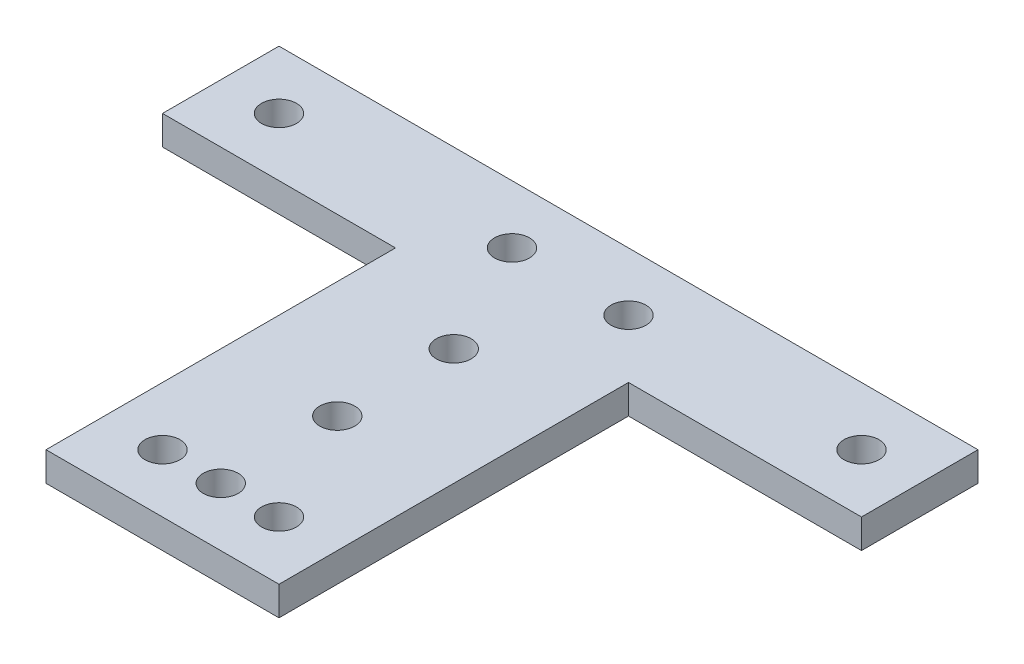
ISO-10303-21;
HEADER;
FILE_DESCRIPTION(('STEP AP214'),'2;1');
FILE_NAME('part.step','',(''),(''),'','','');
FILE_SCHEMA(('AUTOMOTIVE_DESIGN { 1 0 10303 214 1 1 1 1 }'));
ENDSEC;
DATA;
#1=APPLICATION_CONTEXT('core data for automotive mechanical design processes');
#2=APPLICATION_PROTOCOL_DEFINITION('international standard','automotive_design',2000,#1);
#3=PRODUCT_CONTEXT('',#1,'mechanical');
#4=PRODUCT('Part','Part','',(#3));
#5=PRODUCT_RELATED_PRODUCT_CATEGORY('part','',(#4));
#6=PRODUCT_DEFINITION_FORMATION('','',#4);
#7=PRODUCT_DEFINITION_CONTEXT('part definition',#1,'design');
#8=PRODUCT_DEFINITION('design','',#6,#7);
#9=PRODUCT_DEFINITION_SHAPE('','',#8);
#10=(LENGTH_UNIT() NAMED_UNIT(*) SI_UNIT(.MILLI.,.METRE.));
#11=(NAMED_UNIT(*) PLANE_ANGLE_UNIT() SI_UNIT($,.RADIAN.));
#12=(NAMED_UNIT(*) SI_UNIT($,.STERADIAN.) SOLID_ANGLE_UNIT());
#13=UNCERTAINTY_MEASURE_WITH_UNIT(LENGTH_MEASURE(1.E-05),#10,'distance_accuracy_value','');
#14=(GEOMETRIC_REPRESENTATION_CONTEXT(3) GLOBAL_UNCERTAINTY_ASSIGNED_CONTEXT((#13)) GLOBAL_UNIT_ASSIGNED_CONTEXT((#10,
#11,#12)) REPRESENTATION_CONTEXT('',''));
#15=CARTESIAN_POINT('',(0.,0.,0.));
#16=DIRECTION('',(0.,0.,1.));
#17=DIRECTION('',(1.,0.,0.));
#18=AXIS2_PLACEMENT_3D('',#15,#16,#17);
#19=CARTESIAN_POINT('',(-30.,2.5,5.));
#20=DIRECTION('',(0.,1.,0.));
#21=DIRECTION('',(0.,0.,1.));
#22=AXIS2_PLACEMENT_3D('',#19,#20,#21);
#23=PLANE('',#22);
#24=CARTESIAN_POINT('',(0.,2.5,20.));
#25=DIRECTION('',(0.,1.,0.));
#26=DIRECTION('',(0.,0.,1.));
#27=AXIS2_PLACEMENT_3D('',#24,#25,#26);
#28=CIRCLE('',#27,1.5);
#29=CARTESIAN_POINT('',(0.,2.5,21.5));
#30=VERTEX_POINT('',#29);
#31=EDGE_CURVE('E218',#30,#30,#28,.T.);
#32=ORIENTED_EDGE('',*,*,#31,.F.);
#33=EDGE_LOOP('',(#32));
#34=FACE_BOUND('',#33,.T.);
#35=CARTESIAN_POINT('',(5.,2.5,30.));
#36=DIRECTION('',(0.,1.,0.));
#37=DIRECTION('',(0.,0.,1.));
#38=AXIS2_PLACEMENT_3D('',#35,#36,#37);
#39=CIRCLE('',#38,1.5);
#40=CARTESIAN_POINT('',(5.,2.5,31.5));
#41=VERTEX_POINT('',#40);
#42=EDGE_CURVE('E206',#41,#41,#39,.T.);
#43=ORIENTED_EDGE('',*,*,#42,.F.);
#44=EDGE_LOOP('',(#43));
#45=FACE_BOUND('',#44,.T.);
#46=CARTESIAN_POINT('',(5.,2.5,0.));
#47=DIRECTION('',(0.,1.,0.));
#48=DIRECTION('',(0.,0.,1.));
#49=AXIS2_PLACEMENT_3D('',#46,#47,#48);
#50=CIRCLE('',#49,1.5);
#51=CARTESIAN_POINT('',(5.,2.5,1.5));
#52=VERTEX_POINT('',#51);
#53=EDGE_CURVE('E194',#52,#52,#50,.T.);
#54=ORIENTED_EDGE('',*,*,#53,.F.);
#55=EDGE_LOOP('',(#54));
#56=FACE_BOUND('',#55,.T.);
#57=CARTESIAN_POINT('',(25.,2.5,0.));
#58=DIRECTION('',(0.,1.,0.));
#59=DIRECTION('',(0.,0.,1.));
#60=AXIS2_PLACEMENT_3D('',#57,#58,#59);
#61=CIRCLE('',#60,1.5);
#62=CARTESIAN_POINT('',(25.,2.5,1.5));
#63=VERTEX_POINT('',#62);
#64=EDGE_CURVE('E182',#63,#63,#61,.T.);
#65=ORIENTED_EDGE('',*,*,#64,.F.);
#66=EDGE_LOOP('',(#65));
#67=FACE_BOUND('',#66,.T.);
#68=DIRECTION('',(0.,0.,1.));
#69=VECTOR('',#68,1.);
#70=CARTESIAN_POINT('',(-30.,2.5,-5.));
#71=LINE('',#70,#69);
#72=CARTESIAN_POINT('',(-30.,2.5,-5.));
#73=VERTEX_POINT('',#72);
#74=CARTESIAN_POINT('',(-30.,2.5,5.));
#75=VERTEX_POINT('',#74);
#76=EDGE_CURVE('E145',#73,#75,#71,.T.);
#77=ORIENTED_EDGE('',*,*,#76,.T.);
#78=DIRECTION('',(1.,0.,0.));
#79=VECTOR('',#78,1.);
#80=CARTESIAN_POINT('',(-30.,2.5,5.));
#81=LINE('',#80,#79);
#82=CARTESIAN_POINT('',(-10.,2.5,5.));
#83=VERTEX_POINT('',#82);
#84=EDGE_CURVE('E93',#75,#83,#81,.T.);
#85=ORIENTED_EDGE('',*,*,#84,.T.);
#86=DIRECTION('',(0.,0.,1.));
#87=VECTOR('',#86,1.);
#88=CARTESIAN_POINT('',(-10.,2.5,5.));
#89=LINE('',#88,#87);
#90=CARTESIAN_POINT('',(-9.99999999999999,2.5,35.));
#91=VERTEX_POINT('',#90);
#92=EDGE_CURVE('E160',#83,#91,#89,.T.);
#93=ORIENTED_EDGE('',*,*,#92,.T.);
#94=DIRECTION('',(1.,0.,0.));
#95=VECTOR('',#94,1.);
#96=CARTESIAN_POINT('',(-9.99999999999999,2.5,35.));
#97=LINE('',#96,#95);
#98=CARTESIAN_POINT('',(10.,2.5,35.));
#99=VERTEX_POINT('',#98);
#100=EDGE_CURVE('E173',#91,#99,#97,.T.);
#101=ORIENTED_EDGE('',*,*,#100,.T.);
#102=DIRECTION('',(0.,0.,-1.));
#103=VECTOR('',#102,1.);
#104=CARTESIAN_POINT('',(10.,2.5,35.));
#105=LINE('',#104,#103);
#106=CARTESIAN_POINT('',(10.,2.5,5.));
#107=VERTEX_POINT('',#106);
#108=EDGE_CURVE('E112',#99,#107,#105,.T.);
#109=ORIENTED_EDGE('',*,*,#108,.T.);
#110=DIRECTION('',(1.,0.,0.));
#111=VECTOR('',#110,1.);
#112=CARTESIAN_POINT('',(10.,2.5,5.));
#113=LINE('',#112,#111);
#114=CARTESIAN_POINT('',(30.,2.5,5.));
#115=VERTEX_POINT('',#114);
#116=EDGE_CURVE('E106',#107,#115,#113,.T.);
#117=ORIENTED_EDGE('',*,*,#116,.T.);
#118=DIRECTION('',(0.,0.,-1.));
#119=VECTOR('',#118,1.);
#120=CARTESIAN_POINT('',(30.,2.5,-5.));
#121=LINE('',#120,#119);
#122=CARTESIAN_POINT('',(30.,2.5,-5.));
#123=VERTEX_POINT('',#122);
#124=EDGE_CURVE('E110',#115,#123,#121,.T.);
#125=ORIENTED_EDGE('',*,*,#124,.T.);
#126=DIRECTION('',(-1.,0.,0.));
#127=VECTOR('',#126,1.);
#128=CARTESIAN_POINT('',(-30.,2.5,-5.));
#129=LINE('',#128,#127);
#130=EDGE_CURVE('E50',#123,#73,#129,.T.);
#131=ORIENTED_EDGE('',*,*,#130,.T.);
#132=EDGE_LOOP('',(#77,#85,#93,#101,#109,#117,#125,#131));
#133=FACE_BOUND('',#132,.T.);
#134=CARTESIAN_POINT('',(-25.,2.5,0.));
#135=DIRECTION('',(0.,1.,0.));
#136=DIRECTION('',(0.,0.,1.));
#137=AXIS2_PLACEMENT_3D('',#134,#135,#136);
#138=CIRCLE('',#137,1.5);
#139=CARTESIAN_POINT('',(-25.,2.5,1.5));
#140=VERTEX_POINT('',#139);
#141=EDGE_CURVE('E134',#140,#140,#138,.T.);
#142=ORIENTED_EDGE('',*,*,#141,.F.);
#143=EDGE_LOOP('',(#142));
#144=FACE_BOUND('',#143,.T.);
#145=CARTESIAN_POINT('',(-5.,2.5,0.));
#146=DIRECTION('',(0.,1.,0.));
#147=DIRECTION('',(0.,0.,1.));
#148=AXIS2_PLACEMENT_3D('',#145,#146,#147);
#149=CIRCLE('',#148,1.5);
#150=CARTESIAN_POINT('',(-5.,2.5,1.5));
#151=VERTEX_POINT('',#150);
#152=EDGE_CURVE('E188',#151,#151,#149,.T.);
#153=ORIENTED_EDGE('',*,*,#152,.F.);
#154=EDGE_LOOP('',(#153));
#155=FACE_BOUND('',#154,.T.);
#156=CARTESIAN_POINT('',(-5.,2.5,30.));
#157=DIRECTION('',(0.,1.,0.));
#158=DIRECTION('',(0.,0.,1.));
#159=AXIS2_PLACEMENT_3D('',#156,#157,#158);
#160=CIRCLE('',#159,1.5);
#161=CARTESIAN_POINT('',(-5.,2.5,31.5));
#162=VERTEX_POINT('',#161);
#163=EDGE_CURVE('E200',#162,#162,#160,.T.);
#164=ORIENTED_EDGE('',*,*,#163,.F.);
#165=EDGE_LOOP('',(#164));
#166=FACE_BOUND('',#165,.T.);
#167=CARTESIAN_POINT('',(0.,2.5,30.));
#168=DIRECTION('',(0.,1.,0.));
#169=DIRECTION('',(0.,0.,1.));
#170=AXIS2_PLACEMENT_3D('',#167,#168,#169);
#171=CIRCLE('',#170,1.5);
#172=CARTESIAN_POINT('',(0.,2.5,31.5));
#173=VERTEX_POINT('',#172);
#174=EDGE_CURVE('E212',#173,#173,#171,.T.);
#175=ORIENTED_EDGE('',*,*,#174,.F.);
#176=EDGE_LOOP('',(#175));
#177=FACE_BOUND('',#176,.T.);
#178=CARTESIAN_POINT('',(0.,2.5,10.));
#179=DIRECTION('',(0.,1.,0.));
#180=DIRECTION('',(0.,0.,1.));
#181=AXIS2_PLACEMENT_3D('',#178,#179,#180);
#182=CIRCLE('',#181,1.5);
#183=CARTESIAN_POINT('',(0.,2.5,11.5));
#184=VERTEX_POINT('',#183);
#185=EDGE_CURVE('E224',#184,#184,#182,.T.);
#186=ORIENTED_EDGE('',*,*,#185,.F.);
#187=EDGE_LOOP('',(#186));
#188=FACE_BOUND('',#187,.T.);
#189=ADVANCED_FACE('F33',(#34,#45,#56,#67,#133,#144,#155,#166,#177,#188),#23,.T.);
#190=CARTESIAN_POINT('',(-30.,0.,5.));
#191=DIRECTION('',(0.,1.,0.));
#192=DIRECTION('',(0.,0.,1.));
#193=AXIS2_PLACEMENT_3D('',#190,#191,#192);
#194=PLANE('',#193);
#195=CARTESIAN_POINT('',(0.,0.,20.));
#196=DIRECTION('',(0.,1.,0.));
#197=DIRECTION('',(0.,0.,1.));
#198=AXIS2_PLACEMENT_3D('',#195,#196,#197);
#199=CIRCLE('',#198,1.5);
#200=CARTESIAN_POINT('',(0.,0.,21.5));
#201=VERTEX_POINT('',#200);
#202=EDGE_CURVE('E221',#201,#201,#199,.T.);
#203=ORIENTED_EDGE('',*,*,#202,.T.);
#204=EDGE_LOOP('',(#203));
#205=FACE_BOUND('',#204,.T.);
#206=CARTESIAN_POINT('',(5.,0.,30.));
#207=DIRECTION('',(0.,1.,0.));
#208=DIRECTION('',(0.,0.,1.));
#209=AXIS2_PLACEMENT_3D('',#206,#207,#208);
#210=CIRCLE('',#209,1.5);
#211=CARTESIAN_POINT('',(5.,0.,31.5));
#212=VERTEX_POINT('',#211);
#213=EDGE_CURVE('E209',#212,#212,#210,.T.);
#214=ORIENTED_EDGE('',*,*,#213,.T.);
#215=EDGE_LOOP('',(#214));
#216=FACE_BOUND('',#215,.T.);
#217=CARTESIAN_POINT('',(5.,0.,0.));
#218=DIRECTION('',(0.,1.,0.));
#219=DIRECTION('',(0.,0.,1.));
#220=AXIS2_PLACEMENT_3D('',#217,#218,#219);
#221=CIRCLE('',#220,1.5);
#222=CARTESIAN_POINT('',(5.,0.,1.5));
#223=VERTEX_POINT('',#222);
#224=EDGE_CURVE('E197',#223,#223,#221,.T.);
#225=ORIENTED_EDGE('',*,*,#224,.T.);
#226=EDGE_LOOP('',(#225));
#227=FACE_BOUND('',#226,.T.);
#228=CARTESIAN_POINT('',(25.,0.,0.));
#229=DIRECTION('',(0.,1.,0.));
#230=DIRECTION('',(0.,0.,1.));
#231=AXIS2_PLACEMENT_3D('',#228,#229,#230);
#232=CIRCLE('',#231,1.5);
#233=CARTESIAN_POINT('',(25.,0.,1.5));
#234=VERTEX_POINT('',#233);
#235=EDGE_CURVE('E185',#234,#234,#232,.T.);
#236=ORIENTED_EDGE('',*,*,#235,.T.);
#237=EDGE_LOOP('',(#236));
#238=FACE_BOUND('',#237,.T.);
#239=DIRECTION('',(0.,0.,1.));
#240=VECTOR('',#239,1.);
#241=CARTESIAN_POINT('',(-30.,0.,-5.));
#242=LINE('',#241,#240);
#243=CARTESIAN_POINT('',(-30.,0.,-5.));
#244=VERTEX_POINT('',#243);
#245=CARTESIAN_POINT('',(-30.,0.,5.));
#246=VERTEX_POINT('',#245);
#247=EDGE_CURVE('E130',#244,#246,#242,.T.);
#248=ORIENTED_EDGE('',*,*,#247,.F.);
#249=DIRECTION('',(-1.,0.,0.));
#250=VECTOR('',#249,1.);
#251=CARTESIAN_POINT('',(-30.,0.,-5.));
#252=LINE('',#251,#250);
#253=CARTESIAN_POINT('',(30.,0.,-5.));
#254=VERTEX_POINT('',#253);
#255=EDGE_CURVE('E85',#254,#244,#252,.T.);
#256=ORIENTED_EDGE('',*,*,#255,.F.);
#257=DIRECTION('',(0.,0.,-1.));
#258=VECTOR('',#257,1.);
#259=CARTESIAN_POINT('',(30.,0.,-5.));
#260=LINE('',#259,#258);
#261=CARTESIAN_POINT('',(30.,0.,5.));
#262=VERTEX_POINT('',#261);
#263=EDGE_CURVE('E79',#262,#254,#260,.T.);
#264=ORIENTED_EDGE('',*,*,#263,.F.);
#265=DIRECTION('',(1.,0.,0.));
#266=VECTOR('',#265,1.);
#267=CARTESIAN_POINT('',(10.,0.,5.));
#268=LINE('',#267,#266);
#269=CARTESIAN_POINT('',(10.,0.,5.));
#270=VERTEX_POINT('',#269);
#271=EDGE_CURVE('E120',#270,#262,#268,.T.);
#272=ORIENTED_EDGE('',*,*,#271,.F.);
#273=DIRECTION('',(0.,0.,-1.));
#274=VECTOR('',#273,1.);
#275=CARTESIAN_POINT('',(10.,0.,35.));
#276=LINE('',#275,#274);
#277=CARTESIAN_POINT('',(10.,0.,35.));
#278=VERTEX_POINT('',#277);
#279=EDGE_CURVE('E140',#278,#270,#276,.T.);
#280=ORIENTED_EDGE('',*,*,#279,.F.);
#281=DIRECTION('',(1.,0.,0.));
#282=VECTOR('',#281,1.);
#283=CARTESIAN_POINT('',(-9.99999999999999,0.,35.));
#284=LINE('',#283,#282);
#285=CARTESIAN_POINT('',(-9.99999999999999,0.,35.));
#286=VERTEX_POINT('',#285);
#287=EDGE_CURVE('E138',#286,#278,#284,.T.);
#288=ORIENTED_EDGE('',*,*,#287,.F.);
#289=DIRECTION('',(0.,0.,1.));
#290=VECTOR('',#289,1.);
#291=CARTESIAN_POINT('',(-10.,0.,5.));
#292=LINE('',#291,#290);
#293=CARTESIAN_POINT('',(-10.,0.,5.));
#294=VERTEX_POINT('',#293);
#295=EDGE_CURVE('E136',#294,#286,#292,.T.);
#296=ORIENTED_EDGE('',*,*,#295,.F.);
#297=DIRECTION('',(1.,0.,0.));
#298=VECTOR('',#297,1.);
#299=CARTESIAN_POINT('',(-30.,0.,5.));
#300=LINE('',#299,#298);
#301=EDGE_CURVE('E133',#246,#294,#300,.T.);
#302=ORIENTED_EDGE('',*,*,#301,.F.);
#303=EDGE_LOOP('',(#248,#256,#264,#272,#280,#288,#296,#302));
#304=FACE_BOUND('',#303,.T.);
#305=CARTESIAN_POINT('',(-25.,0.,0.));
#306=DIRECTION('',(0.,1.,0.));
#307=DIRECTION('',(0.,0.,1.));
#308=AXIS2_PLACEMENT_3D('',#305,#306,#307);
#309=CIRCLE('',#308,1.5);
#310=CARTESIAN_POINT('',(-25.,0.,1.5));
#311=VERTEX_POINT('',#310);
#312=EDGE_CURVE('E179',#311,#311,#309,.T.);
#313=ORIENTED_EDGE('',*,*,#312,.T.);
#314=EDGE_LOOP('',(#313));
#315=FACE_BOUND('',#314,.T.);
#316=CARTESIAN_POINT('',(-5.,0.,0.));
#317=DIRECTION('',(0.,1.,0.));
#318=DIRECTION('',(0.,0.,1.));
#319=AXIS2_PLACEMENT_3D('',#316,#317,#318);
#320=CIRCLE('',#319,1.5);
#321=CARTESIAN_POINT('',(-5.,0.,1.5));
#322=VERTEX_POINT('',#321);
#323=EDGE_CURVE('E191',#322,#322,#320,.T.);
#324=ORIENTED_EDGE('',*,*,#323,.T.);
#325=EDGE_LOOP('',(#324));
#326=FACE_BOUND('',#325,.T.);
#327=CARTESIAN_POINT('',(-5.,0.,30.));
#328=DIRECTION('',(0.,1.,0.));
#329=DIRECTION('',(0.,0.,1.));
#330=AXIS2_PLACEMENT_3D('',#327,#328,#329);
#331=CIRCLE('',#330,1.5);
#332=CARTESIAN_POINT('',(-5.,0.,31.5));
#333=VERTEX_POINT('',#332);
#334=EDGE_CURVE('E203',#333,#333,#331,.T.);
#335=ORIENTED_EDGE('',*,*,#334,.T.);
#336=EDGE_LOOP('',(#335));
#337=FACE_BOUND('',#336,.T.);
#338=CARTESIAN_POINT('',(0.,0.,30.));
#339=DIRECTION('',(0.,1.,0.));
#340=DIRECTION('',(0.,0.,1.));
#341=AXIS2_PLACEMENT_3D('',#338,#339,#340);
#342=CIRCLE('',#341,1.5);
#343=CARTESIAN_POINT('',(0.,0.,31.5));
#344=VERTEX_POINT('',#343);
#345=EDGE_CURVE('E215',#344,#344,#342,.T.);
#346=ORIENTED_EDGE('',*,*,#345,.T.);
#347=EDGE_LOOP('',(#346));
#348=FACE_BOUND('',#347,.T.);
#349=CARTESIAN_POINT('',(0.,0.,10.));
#350=DIRECTION('',(0.,1.,0.));
#351=DIRECTION('',(0.,0.,1.));
#352=AXIS2_PLACEMENT_3D('',#349,#350,#351);
#353=CIRCLE('',#352,1.5);
#354=CARTESIAN_POINT('',(0.,0.,11.5));
#355=VERTEX_POINT('',#354);
#356=EDGE_CURVE('E227',#355,#355,#353,.T.);
#357=ORIENTED_EDGE('',*,*,#356,.T.);
#358=EDGE_LOOP('',(#357));
#359=FACE_BOUND('',#358,.T.);
#360=ADVANCED_FACE('F164',(#205,#216,#227,#238,#304,#315,#326,#337,#348,#359),#194,.F.);
#361=CARTESIAN_POINT('',(-30.,2.5,-5.));
#362=DIRECTION('',(1.,0.,0.));
#363=DIRECTION('',(0.,0.,-1.));
#364=AXIS2_PLACEMENT_3D('',#361,#362,#363);
#365=PLANE('',#364);
#366=ORIENTED_EDGE('',*,*,#247,.T.);
#367=DIRECTION('',(0.,-1.,0.));
#368=VECTOR('',#367,1.);
#369=CARTESIAN_POINT('',(-30.,2.5,5.));
#370=LINE('',#369,#368);
#371=EDGE_CURVE('E11',#75,#246,#370,.T.);
#372=ORIENTED_EDGE('',*,*,#371,.F.);
#373=ORIENTED_EDGE('',*,*,#76,.F.);
#374=DIRECTION('',(0.,-1.,0.));
#375=VECTOR('',#374,1.);
#376=CARTESIAN_POINT('',(-30.,2.5,-5.));
#377=LINE('',#376,#375);
#378=EDGE_CURVE('E126',#73,#244,#377,.T.);
#379=ORIENTED_EDGE('',*,*,#378,.T.);
#380=EDGE_LOOP('',(#366,#372,#373,#379));
#381=FACE_BOUND('',#380,.T.);
#382=ADVANCED_FACE('F35',(#381),#365,.F.);
#383=CARTESIAN_POINT('',(-30.,2.5,5.));
#384=DIRECTION('',(0.,0.,-1.));
#385=DIRECTION('',(-1.,0.,0.));
#386=AXIS2_PLACEMENT_3D('',#383,#384,#385);
#387=PLANE('',#386);
#388=ORIENTED_EDGE('',*,*,#301,.T.);
#389=DIRECTION('',(0.,-1.,0.));
#390=VECTOR('',#389,1.);
#391=CARTESIAN_POINT('',(-10.,2.5,5.));
#392=LINE('',#391,#390);
#393=EDGE_CURVE('E42',#83,#294,#392,.T.);
#394=ORIENTED_EDGE('',*,*,#393,.F.);
#395=ORIENTED_EDGE('',*,*,#84,.F.);
#396=ORIENTED_EDGE('',*,*,#371,.T.);
#397=EDGE_LOOP('',(#388,#394,#395,#396));
#398=FACE_BOUND('',#397,.T.);
#399=ADVANCED_FACE('F262',(#398),#387,.F.);
#400=CARTESIAN_POINT('',(-10.,2.5,5.));
#401=DIRECTION('',(1.,0.,0.));
#402=DIRECTION('',(0.,0.,-1.));
#403=AXIS2_PLACEMENT_3D('',#400,#401,#402);
#404=PLANE('',#403);
#405=ORIENTED_EDGE('',*,*,#295,.T.);
#406=DIRECTION('',(0.,-1.,0.));
#407=VECTOR('',#406,1.);
#408=CARTESIAN_POINT('',(-9.99999999999999,2.5,35.));
#409=LINE('',#408,#407);
#410=EDGE_CURVE('E152',#91,#286,#409,.T.);
#411=ORIENTED_EDGE('',*,*,#410,.F.);
#412=ORIENTED_EDGE('',*,*,#92,.F.);
#413=ORIENTED_EDGE('',*,*,#393,.T.);
#414=EDGE_LOOP('',(#405,#411,#412,#413));
#415=FACE_BOUND('',#414,.T.);
#416=ADVANCED_FACE('F158',(#415),#404,.F.);
#417=CARTESIAN_POINT('',(-9.99999999999999,2.5,35.));
#418=DIRECTION('',(0.,0.,-1.));
#419=DIRECTION('',(-1.,0.,0.));
#420=AXIS2_PLACEMENT_3D('',#417,#418,#419);
#421=PLANE('',#420);
#422=ORIENTED_EDGE('',*,*,#287,.T.);
#423=DIRECTION('',(0.,-1.,0.));
#424=VECTOR('',#423,1.);
#425=CARTESIAN_POINT('',(10.,2.5,35.));
#426=LINE('',#425,#424);
#427=EDGE_CURVE('E149',#99,#278,#426,.T.);
#428=ORIENTED_EDGE('',*,*,#427,.F.);
#429=ORIENTED_EDGE('',*,*,#100,.F.);
#430=ORIENTED_EDGE('',*,*,#410,.T.);
#431=EDGE_LOOP('',(#422,#428,#429,#430));
#432=FACE_BOUND('',#431,.T.);
#433=ADVANCED_FACE('F169',(#432),#421,.F.);
#434=CARTESIAN_POINT('',(10.,2.5,35.));
#435=DIRECTION('',(-1.,0.,0.));
#436=DIRECTION('',(0.,0.,1.));
#437=AXIS2_PLACEMENT_3D('',#434,#435,#436);
#438=PLANE('',#437);
#439=ORIENTED_EDGE('',*,*,#279,.T.);
#440=DIRECTION('',(0.,-1.,0.));
#441=VECTOR('',#440,1.);
#442=CARTESIAN_POINT('',(10.,2.5,5.));
#443=LINE('',#442,#441);
#444=EDGE_CURVE('E121',#107,#270,#443,.T.);
#445=ORIENTED_EDGE('',*,*,#444,.F.);
#446=ORIENTED_EDGE('',*,*,#108,.F.);
#447=ORIENTED_EDGE('',*,*,#427,.T.);
#448=EDGE_LOOP('',(#439,#445,#446,#447));
#449=FACE_BOUND('',#448,.T.);
#450=ADVANCED_FACE('F172',(#449),#438,.F.);
#451=CARTESIAN_POINT('',(10.,2.5,5.));
#452=DIRECTION('',(0.,0.,-1.));
#453=DIRECTION('',(-1.,0.,0.));
#454=AXIS2_PLACEMENT_3D('',#451,#452,#453);
#455=PLANE('',#454);
#456=ORIENTED_EDGE('',*,*,#271,.T.);
#457=DIRECTION('',(0.,-1.,0.));
#458=VECTOR('',#457,1.);
#459=CARTESIAN_POINT('',(30.,2.5,5.));
#460=LINE('',#459,#458);
#461=EDGE_CURVE('E117',#115,#262,#460,.T.);
#462=ORIENTED_EDGE('',*,*,#461,.F.);
#463=ORIENTED_EDGE('',*,*,#116,.F.);
#464=ORIENTED_EDGE('',*,*,#444,.T.);
#465=EDGE_LOOP('',(#456,#462,#463,#464));
#466=FACE_BOUND('',#465,.T.);
#467=ADVANCED_FACE('F118',(#466),#455,.F.);
#468=CARTESIAN_POINT('',(30.,2.5,-5.));
#469=DIRECTION('',(-1.,0.,0.));
#470=DIRECTION('',(0.,0.,1.));
#471=AXIS2_PLACEMENT_3D('',#468,#469,#470);
#472=PLANE('',#471);
#473=ORIENTED_EDGE('',*,*,#263,.T.);
#474=DIRECTION('',(0.,-1.,0.));
#475=VECTOR('',#474,1.);
#476=CARTESIAN_POINT('',(30.,2.5,-5.));
#477=LINE('',#476,#475);
#478=EDGE_CURVE('E122',#123,#254,#477,.T.);
#479=ORIENTED_EDGE('',*,*,#478,.F.);
#480=ORIENTED_EDGE('',*,*,#124,.F.);
#481=ORIENTED_EDGE('',*,*,#461,.T.);
#482=EDGE_LOOP('',(#473,#479,#480,#481));
#483=FACE_BOUND('',#482,.T.);
#484=ADVANCED_FACE('F124',(#483),#472,.F.);
#485=CARTESIAN_POINT('',(-30.,2.5,-5.));
#486=DIRECTION('',(0.,0.,1.));
#487=DIRECTION('',(1.,0.,0.));
#488=AXIS2_PLACEMENT_3D('',#485,#486,#487);
#489=PLANE('',#488);
#490=ORIENTED_EDGE('',*,*,#255,.T.);
#491=ORIENTED_EDGE('',*,*,#378,.F.);
#492=ORIENTED_EDGE('',*,*,#130,.F.);
#493=ORIENTED_EDGE('',*,*,#478,.T.);
#494=EDGE_LOOP('',(#490,#491,#492,#493));
#495=FACE_BOUND('',#494,.T.);
#496=ADVANCED_FACE('F250',(#495),#489,.F.);
#497=CARTESIAN_POINT('',(-25.,2.5,0.));
#498=DIRECTION('',(0.,-1.,0.));
#499=DIRECTION('',(0.,0.,-1.));
#500=AXIS2_PLACEMENT_3D('',#497,#498,#499);
#501=CYLINDRICAL_SURFACE('',#500,1.5);
#502=ORIENTED_EDGE('',*,*,#141,.T.);
#503=EDGE_LOOP('',(#502));
#504=FACE_BOUND('',#503,.T.);
#505=ORIENTED_EDGE('',*,*,#312,.F.);
#506=EDGE_LOOP('',(#505));
#507=FACE_BOUND('',#506,.T.);
#508=ADVANCED_FACE('F247',(#504,#507),#501,.F.);
#509=CARTESIAN_POINT('',(25.,2.5,0.));
#510=DIRECTION('',(0.,-1.,0.));
#511=DIRECTION('',(0.,0.,-1.));
#512=AXIS2_PLACEMENT_3D('',#509,#510,#511);
#513=CYLINDRICAL_SURFACE('',#512,1.5);
#514=ORIENTED_EDGE('',*,*,#64,.T.);
#515=EDGE_LOOP('',(#514));
#516=FACE_BOUND('',#515,.T.);
#517=ORIENTED_EDGE('',*,*,#235,.F.);
#518=EDGE_LOOP('',(#517));
#519=FACE_BOUND('',#518,.T.);
#520=ADVANCED_FACE('F326',(#516,#519),#513,.F.);
#521=CARTESIAN_POINT('',(-5.,2.5,0.));
#522=DIRECTION('',(0.,-1.,0.));
#523=DIRECTION('',(0.,0.,-1.));
#524=AXIS2_PLACEMENT_3D('',#521,#522,#523);
#525=CYLINDRICAL_SURFACE('',#524,1.5);
#526=ORIENTED_EDGE('',*,*,#152,.T.);
#527=EDGE_LOOP('',(#526));
#528=FACE_BOUND('',#527,.T.);
#529=ORIENTED_EDGE('',*,*,#323,.F.);
#530=EDGE_LOOP('',(#529));
#531=FACE_BOUND('',#530,.T.);
#532=ADVANCED_FACE('F334',(#528,#531),#525,.F.);
#533=CARTESIAN_POINT('',(5.,2.5,0.));
#534=DIRECTION('',(0.,-1.,0.));
#535=DIRECTION('',(0.,0.,-1.));
#536=AXIS2_PLACEMENT_3D('',#533,#534,#535);
#537=CYLINDRICAL_SURFACE('',#536,1.5);
#538=ORIENTED_EDGE('',*,*,#53,.T.);
#539=EDGE_LOOP('',(#538));
#540=FACE_BOUND('',#539,.T.);
#541=ORIENTED_EDGE('',*,*,#224,.F.);
#542=EDGE_LOOP('',(#541));
#543=FACE_BOUND('',#542,.T.);
#544=ADVANCED_FACE('F342',(#540,#543),#537,.F.);
#545=CARTESIAN_POINT('',(-5.,2.5,30.));
#546=DIRECTION('',(0.,-1.,0.));
#547=DIRECTION('',(0.,0.,-1.));
#548=AXIS2_PLACEMENT_3D('',#545,#546,#547);
#549=CYLINDRICAL_SURFACE('',#548,1.5);
#550=ORIENTED_EDGE('',*,*,#163,.T.);
#551=EDGE_LOOP('',(#550));
#552=FACE_BOUND('',#551,.T.);
#553=ORIENTED_EDGE('',*,*,#334,.F.);
#554=EDGE_LOOP('',(#553));
#555=FACE_BOUND('',#554,.T.);
#556=ADVANCED_FACE('F351',(#552,#555),#549,.F.);
#557=CARTESIAN_POINT('',(5.,2.5,30.));
#558=DIRECTION('',(0.,-1.,0.));
#559=DIRECTION('',(0.,0.,-1.));
#560=AXIS2_PLACEMENT_3D('',#557,#558,#559);
#561=CYLINDRICAL_SURFACE('',#560,1.5);
#562=ORIENTED_EDGE('',*,*,#42,.T.);
#563=EDGE_LOOP('',(#562));
#564=FACE_BOUND('',#563,.T.);
#565=ORIENTED_EDGE('',*,*,#213,.F.);
#566=EDGE_LOOP('',(#565));
#567=FACE_BOUND('',#566,.T.);
#568=ADVANCED_FACE('F360',(#564,#567),#561,.F.);
#569=CARTESIAN_POINT('',(0.,2.5,30.));
#570=DIRECTION('',(0.,-1.,0.));
#571=DIRECTION('',(0.,0.,-1.));
#572=AXIS2_PLACEMENT_3D('',#569,#570,#571);
#573=CYLINDRICAL_SURFACE('',#572,1.5);
#574=ORIENTED_EDGE('',*,*,#174,.T.);
#575=EDGE_LOOP('',(#574));
#576=FACE_BOUND('',#575,.T.);
#577=ORIENTED_EDGE('',*,*,#345,.F.);
#578=EDGE_LOOP('',(#577));
#579=FACE_BOUND('',#578,.T.);
#580=ADVANCED_FACE('F369',(#576,#579),#573,.F.);
#581=CARTESIAN_POINT('',(0.,2.5,20.));
#582=DIRECTION('',(0.,-1.,0.));
#583=DIRECTION('',(0.,0.,-1.));
#584=AXIS2_PLACEMENT_3D('',#581,#582,#583);
#585=CYLINDRICAL_SURFACE('',#584,1.5);
#586=ORIENTED_EDGE('',*,*,#31,.T.);
#587=EDGE_LOOP('',(#586));
#588=FACE_BOUND('',#587,.T.);
#589=ORIENTED_EDGE('',*,*,#202,.F.);
#590=EDGE_LOOP('',(#589));
#591=FACE_BOUND('',#590,.T.);
#592=ADVANCED_FACE('F378',(#588,#591),#585,.F.);
#593=CARTESIAN_POINT('',(0.,2.5,10.));
#594=DIRECTION('',(0.,-1.,0.));
#595=DIRECTION('',(0.,0.,-1.));
#596=AXIS2_PLACEMENT_3D('',#593,#594,#595);
#597=CYLINDRICAL_SURFACE('',#596,1.5);
#598=ORIENTED_EDGE('',*,*,#185,.T.);
#599=EDGE_LOOP('',(#598));
#600=FACE_BOUND('',#599,.T.);
#601=ORIENTED_EDGE('',*,*,#356,.F.);
#602=EDGE_LOOP('',(#601));
#603=FACE_BOUND('',#602,.T.);
#604=ADVANCED_FACE('F233',(#600,#603),#597,.F.);
#605=CLOSED_SHELL('',(#189,#360,#382,#399,#416,#433,#450,#467,#484,#496,#508,#520,#532,#544,
#556,#568,#580,#592,#604));
#606=MANIFOLD_SOLID_BREP('B2',#605);
#607=ADVANCED_BREP_SHAPE_REPRESENTATION('',(#18,#606),#14);
#608=SHAPE_DEFINITION_REPRESENTATION(#9,#607);
ENDSEC;
END-ISO-10303-21;
